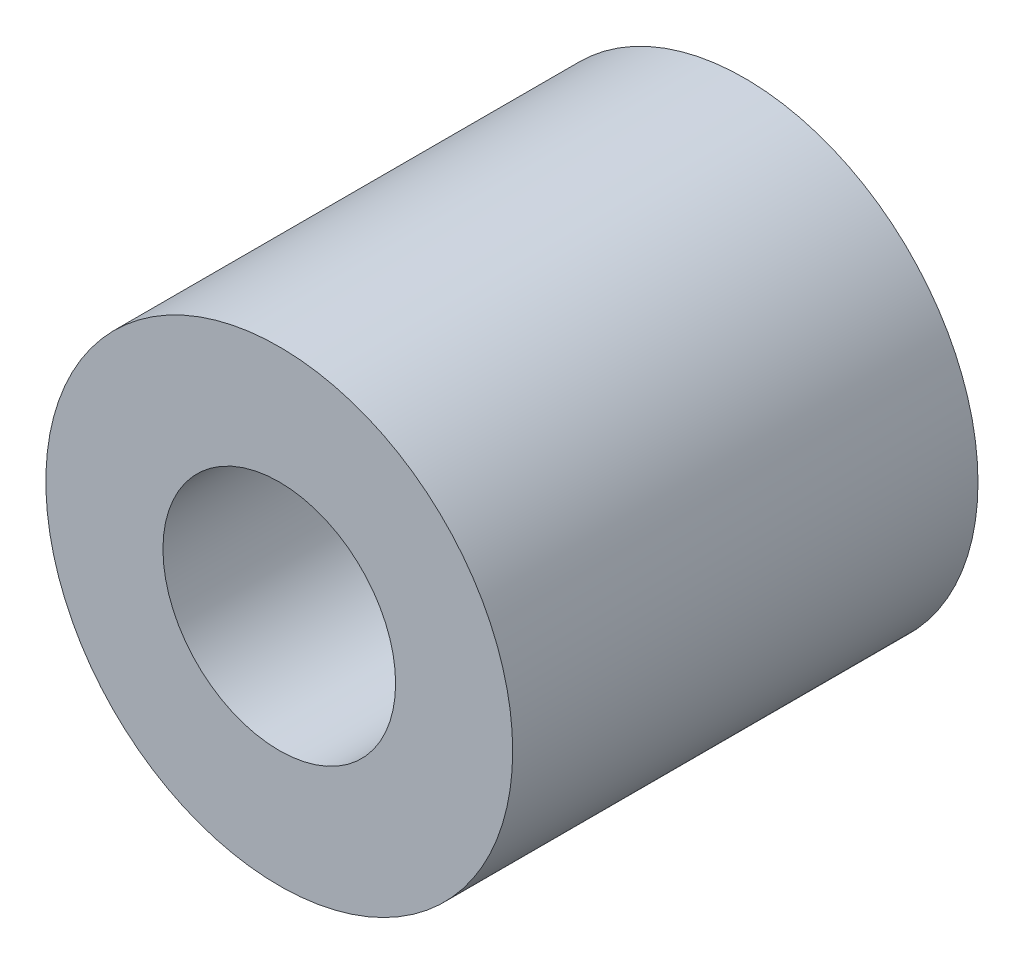
ISO-10303-21;
HEADER;
FILE_DESCRIPTION(('STEP AP214'),'2;1');
FILE_NAME('part.step','',(''),(''),'','','');
FILE_SCHEMA(('AUTOMOTIVE_DESIGN { 1 0 10303 214 1 1 1 1 }'));
ENDSEC;
DATA;
#1=APPLICATION_CONTEXT('core data for automotive mechanical design processes');
#2=APPLICATION_PROTOCOL_DEFINITION('international standard','automotive_design',2000,#1);
#3=PRODUCT_CONTEXT('',#1,'mechanical');
#4=PRODUCT('Part','Part','',(#3));
#5=PRODUCT_RELATED_PRODUCT_CATEGORY('part','',(#4));
#6=PRODUCT_DEFINITION_FORMATION('','',#4);
#7=PRODUCT_DEFINITION_CONTEXT('part definition',#1,'design');
#8=PRODUCT_DEFINITION('design','',#6,#7);
#9=PRODUCT_DEFINITION_SHAPE('','',#8);
#10=(LENGTH_UNIT() NAMED_UNIT(*) SI_UNIT(.MILLI.,.METRE.));
#11=(NAMED_UNIT(*) PLANE_ANGLE_UNIT() SI_UNIT($,.RADIAN.));
#12=(NAMED_UNIT(*) SI_UNIT($,.STERADIAN.) SOLID_ANGLE_UNIT());
#13=UNCERTAINTY_MEASURE_WITH_UNIT(LENGTH_MEASURE(1.E-05),#10,'distance_accuracy_value','');
#14=(GEOMETRIC_REPRESENTATION_CONTEXT(3) GLOBAL_UNCERTAINTY_ASSIGNED_CONTEXT((#13)) GLOBAL_UNIT_ASSIGNED_CONTEXT((#10,
#11,#12)) REPRESENTATION_CONTEXT('',''));
#15=CARTESIAN_POINT('',(0.,0.,0.));
#16=DIRECTION('',(0.,0.,1.));
#17=DIRECTION('',(1.,0.,0.));
#18=AXIS2_PLACEMENT_3D('',#15,#16,#17);
#19=CARTESIAN_POINT('',(0.,0.,3.));
#20=DIRECTION('',(0.,0.,1.));
#21=DIRECTION('',(1.,0.,0.));
#22=AXIS2_PLACEMENT_3D('',#19,#20,#21);
#23=PLANE('',#22);
#24=CARTESIAN_POINT('',(0.,0.,3.));
#25=DIRECTION('',(0.,0.,1.));
#26=DIRECTION('',(1.,0.,0.));
#27=AXIS2_PLACEMENT_3D('',#24,#25,#26);
#28=CIRCLE('',#27,3.01);
#29=CARTESIAN_POINT('',(3.01,0.,3.));
#30=VERTEX_POINT('',#29);
#31=EDGE_CURVE('E10',#30,#30,#28,.T.);
#32=ORIENTED_EDGE('',*,*,#31,.T.);
#33=EDGE_LOOP('',(#32));
#34=FACE_BOUND('',#33,.T.);
#35=CARTESIAN_POINT('',(0.,0.,3.));
#36=DIRECTION('',(0.,0.,1.));
#37=DIRECTION('',(1.,0.,0.));
#38=AXIS2_PLACEMENT_3D('',#35,#36,#37);
#39=CIRCLE('',#38,1.5);
#40=CARTESIAN_POINT('',(1.5,0.,3.));
#41=VERTEX_POINT('',#40);
#42=EDGE_CURVE('E43',#41,#41,#39,.T.);
#43=ORIENTED_EDGE('',*,*,#42,.F.);
#44=EDGE_LOOP('',(#43));
#45=FACE_BOUND('',#44,.T.);
#46=ADVANCED_FACE('F32',(#34,#45),#23,.T.);
#47=CARTESIAN_POINT('',(0.,0.,-3.));
#48=DIRECTION('',(0.,0.,1.));
#49=DIRECTION('',(1.,0.,0.));
#50=AXIS2_PLACEMENT_3D('',#47,#48,#49);
#51=PLANE('',#50);
#52=CARTESIAN_POINT('',(0.,0.,-3.));
#53=DIRECTION('',(0.,0.,1.));
#54=DIRECTION('',(1.,0.,0.));
#55=AXIS2_PLACEMENT_3D('',#52,#53,#54);
#56=CIRCLE('',#55,3.01);
#57=CARTESIAN_POINT('',(3.01,0.,-3.));
#58=VERTEX_POINT('',#57);
#59=EDGE_CURVE('E36',#58,#58,#56,.T.);
#60=ORIENTED_EDGE('',*,*,#59,.F.);
#61=EDGE_LOOP('',(#60));
#62=FACE_BOUND('',#61,.T.);
#63=CARTESIAN_POINT('',(0.,0.,-3.));
#64=DIRECTION('',(0.,0.,1.));
#65=DIRECTION('',(1.,0.,0.));
#66=AXIS2_PLACEMENT_3D('',#63,#64,#65);
#67=CIRCLE('',#66,1.5);
#68=CARTESIAN_POINT('',(1.5,0.,-3.));
#69=VERTEX_POINT('',#68);
#70=EDGE_CURVE('E45',#69,#69,#67,.T.);
#71=ORIENTED_EDGE('',*,*,#70,.T.);
#72=EDGE_LOOP('',(#71));
#73=FACE_BOUND('',#72,.T.);
#74=ADVANCED_FACE('F55',(#62,#73),#51,.F.);
#75=CARTESIAN_POINT('',(0.,0.,3.));
#76=DIRECTION('',(0.,0.,-1.));
#77=DIRECTION('',(-1.,0.,0.));
#78=AXIS2_PLACEMENT_3D('',#75,#76,#77);
#79=CYLINDRICAL_SURFACE('',#78,3.01);
#80=ORIENTED_EDGE('',*,*,#31,.F.);
#81=EDGE_LOOP('',(#80));
#82=FACE_BOUND('',#81,.T.);
#83=ORIENTED_EDGE('',*,*,#59,.T.);
#84=EDGE_LOOP('',(#83));
#85=FACE_BOUND('',#84,.T.);
#86=ADVANCED_FACE('F34',(#82,#85),#79,.T.);
#87=CARTESIAN_POINT('',(0.,0.,3.));
#88=DIRECTION('',(0.,0.,-1.));
#89=DIRECTION('',(-1.,0.,0.));
#90=AXIS2_PLACEMENT_3D('',#87,#88,#89);
#91=CYLINDRICAL_SURFACE('',#90,1.5);
#92=ORIENTED_EDGE('',*,*,#42,.T.);
#93=EDGE_LOOP('',(#92));
#94=FACE_BOUND('',#93,.T.);
#95=ORIENTED_EDGE('',*,*,#70,.F.);
#96=EDGE_LOOP('',(#95));
#97=FACE_BOUND('',#96,.T.);
#98=ADVANCED_FACE('F51',(#94,#97),#91,.F.);
#99=CLOSED_SHELL('',(#46,#74,#86,#98));
#100=MANIFOLD_SOLID_BREP('B2',#99);
#101=ADVANCED_BREP_SHAPE_REPRESENTATION('',(#18,#100),#14);
#102=SHAPE_DEFINITION_REPRESENTATION(#9,#101);
ENDSEC;
END-ISO-10303-21;
